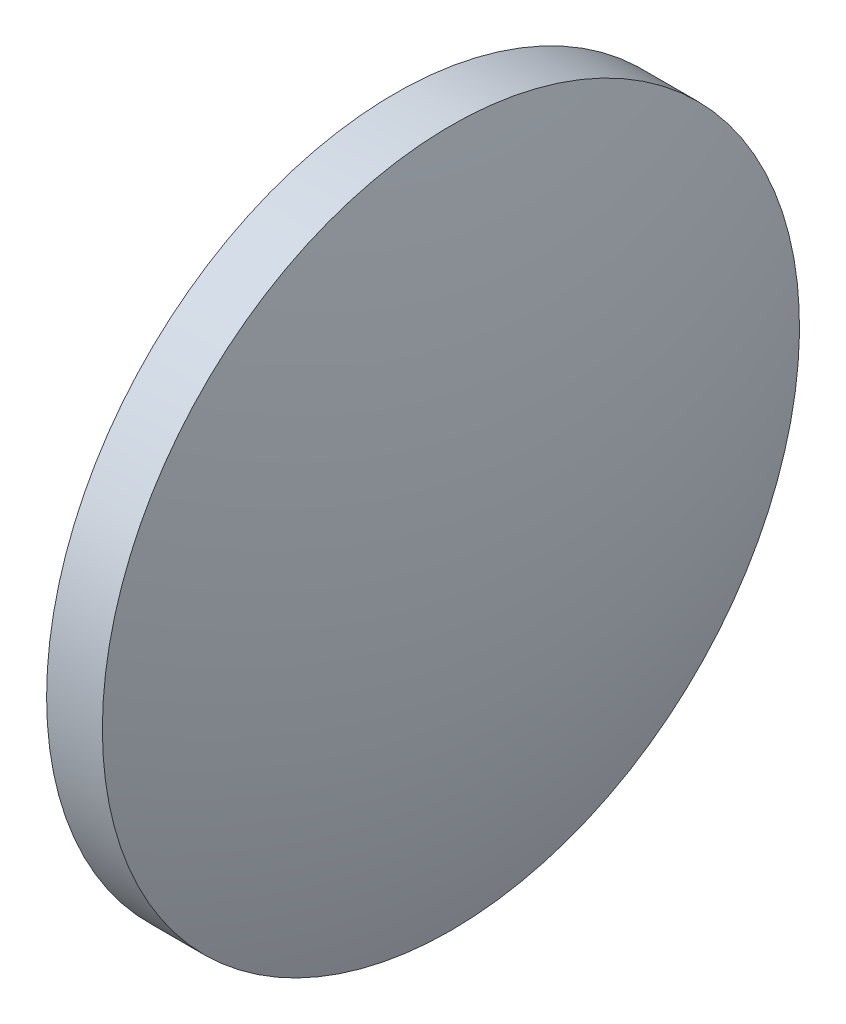
ISO-10303-21;
HEADER;
FILE_DESCRIPTION(('STEP AP214'),'2;1');
FILE_NAME('part.step','',(''),(''),'','','');
FILE_SCHEMA(('AUTOMOTIVE_DESIGN { 1 0 10303 214 1 1 1 1 }'));
ENDSEC;
DATA;
#1=APPLICATION_CONTEXT('core data for automotive mechanical design processes');
#2=APPLICATION_PROTOCOL_DEFINITION('international standard','automotive_design',2000,#1);
#3=PRODUCT_CONTEXT('',#1,'mechanical');
#4=PRODUCT('Part','Part','',(#3));
#5=PRODUCT_RELATED_PRODUCT_CATEGORY('part','',(#4));
#6=PRODUCT_DEFINITION_FORMATION('','',#4);
#7=PRODUCT_DEFINITION_CONTEXT('part definition',#1,'design');
#8=PRODUCT_DEFINITION('design','',#6,#7);
#9=PRODUCT_DEFINITION_SHAPE('','',#8);
#10=(LENGTH_UNIT() NAMED_UNIT(*) SI_UNIT(.MILLI.,.METRE.));
#11=(NAMED_UNIT(*) PLANE_ANGLE_UNIT() SI_UNIT($,.RADIAN.));
#12=(NAMED_UNIT(*) SI_UNIT($,.STERADIAN.) SOLID_ANGLE_UNIT());
#13=UNCERTAINTY_MEASURE_WITH_UNIT(LENGTH_MEASURE(1.E-05),#10,'distance_accuracy_value','');
#14=(GEOMETRIC_REPRESENTATION_CONTEXT(3) GLOBAL_UNCERTAINTY_ASSIGNED_CONTEXT((#13)) GLOBAL_UNIT_ASSIGNED_CONTEXT((#10,
#11,#12)) REPRESENTATION_CONTEXT('',''));
#15=CARTESIAN_POINT('',(0.,0.,0.));
#16=DIRECTION('',(0.,0.,1.));
#17=DIRECTION('',(1.,0.,0.));
#18=AXIS2_PLACEMENT_3D('',#15,#16,#17);
#19=CARTESIAN_POINT('',(808.955282766913,251.606730536811,0.));
#20=DIRECTION('',(-1.,0.,0.));
#21=DIRECTION('',(0.,-1.,0.));
#22=AXIS2_PLACEMENT_3D('',#19,#20,#21);
#23=SPHERICAL_SURFACE('',#22,41.2406185567011);
#24=CARTESIAN_POINT('',(848.255901323614,251.606730536811,0.));
#25=DIRECTION('',(-1.,0.,0.));
#26=DIRECTION('',(0.,0.,1.));
#27=AXIS2_PLACEMENT_3D('',#24,#25,#26);
#28=CIRCLE('',#27,12.5);
#29=CARTESIAN_POINT('',(848.255901323614,251.606730536811,12.5));
#30=VERTEX_POINT('',#29);
#31=EDGE_CURVE('E10',#30,#30,#28,.T.);
#32=ORIENTED_EDGE('',*,*,#31,.F.);
#33=EDGE_LOOP('',(#32));
#34=FACE_BOUND('',#33,.T.);
#35=ADVANCED_FACE('F35',(#34),#23,.T.);
#36=CARTESIAN_POINT('',(843.890285420853,251.606730536811,0.));
#37=DIRECTION('',(-1.,0.,0.));
#38=DIRECTION('',(0.,0.,1.));
#39=AXIS2_PLACEMENT_3D('',#36,#37,#38);
#40=CYLINDRICAL_SURFACE('',#39,12.5);
#41=CARTESIAN_POINT('',(846.255901323614,251.606730536811,0.));
#42=DIRECTION('',(-1.,0.,0.));
#43=DIRECTION('',(0.,0.,1.));
#44=AXIS2_PLACEMENT_3D('',#41,#42,#43);
#45=CIRCLE('',#44,12.5);
#46=CARTESIAN_POINT('',(846.255901323614,251.606730536811,12.5));
#47=VERTEX_POINT('',#46);
#48=EDGE_CURVE('E41',#47,#47,#45,.T.);
#49=ORIENTED_EDGE('',*,*,#48,.F.);
#50=EDGE_LOOP('',(#49));
#51=FACE_BOUND('',#50,.T.);
#52=ORIENTED_EDGE('',*,*,#31,.T.);
#53=EDGE_LOOP('',(#52));
#54=FACE_BOUND('',#53,.T.);
#55=ADVANCED_FACE('F49',(#51,#54),#40,.T.);
#56=CARTESIAN_POINT('',(846.255901323614,251.606730536811,0.));
#57=DIRECTION('',(1.,0.,0.));
#58=DIRECTION('',(0.,0.,-1.));
#59=AXIS2_PLACEMENT_3D('',#56,#57,#58);
#60=PLANE('',#59);
#61=ORIENTED_EDGE('',*,*,#48,.T.);
#62=EDGE_LOOP('',(#61));
#63=FACE_BOUND('',#62,.T.);
#64=ADVANCED_FACE('F47',(#63),#60,.F.);
#65=CLOSED_SHELL('',(#35,#55,#64));
#66=MANIFOLD_SOLID_BREP('B2',#65);
#67=ADVANCED_BREP_SHAPE_REPRESENTATION('',(#18,#66),#14);
#68=SHAPE_DEFINITION_REPRESENTATION(#9,#67);
ENDSEC;
END-ISO-10303-21;
